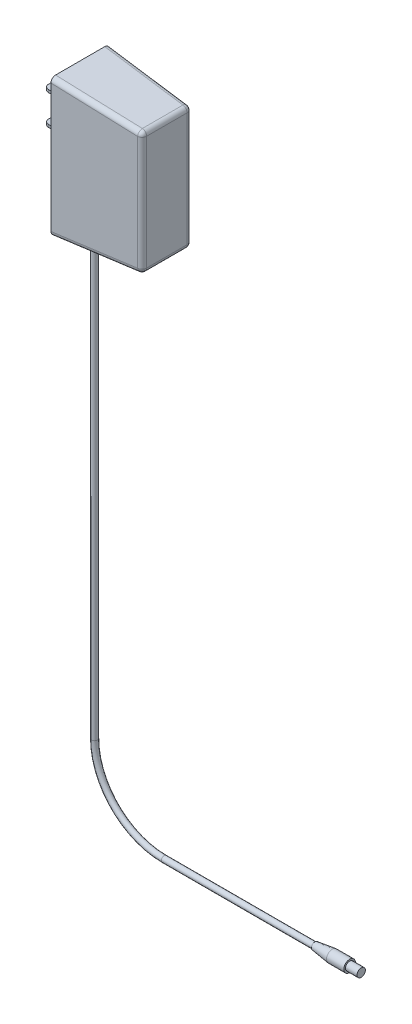
ISO-10303-21;
HEADER;
FILE_DESCRIPTION(('STEP AP214'),'2;1');
FILE_NAME('part.step','',(''),(''),'','','');
FILE_SCHEMA(('AUTOMOTIVE_DESIGN { 1 0 10303 214 1 1 1 1 }'));
ENDSEC;
DATA;
#1=APPLICATION_CONTEXT('core data for automotive mechanical design processes');
#2=APPLICATION_PROTOCOL_DEFINITION('international standard','automotive_design',2000,#1);
#3=PRODUCT_CONTEXT('',#1,'mechanical');
#4=PRODUCT('Part','Part','',(#3));
#5=PRODUCT_RELATED_PRODUCT_CATEGORY('part','',(#4));
#6=PRODUCT_DEFINITION_FORMATION('','',#4);
#7=PRODUCT_DEFINITION_CONTEXT('part definition',#1,'design');
#8=PRODUCT_DEFINITION('design','',#6,#7);
#9=PRODUCT_DEFINITION_SHAPE('','',#8);
#10=(LENGTH_UNIT() NAMED_UNIT(*) SI_UNIT(.MILLI.,.METRE.));
#11=(NAMED_UNIT(*) PLANE_ANGLE_UNIT() SI_UNIT($,.RADIAN.));
#12=(NAMED_UNIT(*) SI_UNIT($,.STERADIAN.) SOLID_ANGLE_UNIT());
#13=UNCERTAINTY_MEASURE_WITH_UNIT(LENGTH_MEASURE(1.E-05),#10,'distance_accuracy_value','');
#14=(GEOMETRIC_REPRESENTATION_CONTEXT(3) GLOBAL_UNCERTAINTY_ASSIGNED_CONTEXT((#13)) GLOBAL_UNIT_ASSIGNED_CONTEXT((#10,
#11,#12)) REPRESENTATION_CONTEXT('',''));
#15=CARTESIAN_POINT('',(0.,0.,0.));
#16=DIRECTION('',(0.,0.,1.));
#17=DIRECTION('',(1.,0.,0.));
#18=AXIS2_PLACEMENT_3D('',#15,#16,#17);
#19=CARTESIAN_POINT('',(-139.7,38.1,0.));
#20=DIRECTION('',(0.,1.,0.));
#21=DIRECTION('',(0.,0.,1.));
#22=AXIS2_PLACEMENT_3D('',#19,#20,#21);
#23=CYLINDRICAL_SURFACE('',#22,1.5875);
#24=CARTESIAN_POINT('',(-139.7,38.1,0.));
#25=DIRECTION('',(0.,-1.,0.));
#26=DIRECTION('',(0.,0.,-1.));
#27=AXIS2_PLACEMENT_3D('',#24,#25,#26);
#28=CIRCLE('',#27,1.5875);
#29=CARTESIAN_POINT('',(-141.2875,38.1,0.));
#30=VERTEX_POINT('',#29);
#31=EDGE_CURVE('E283',#30,#30,#28,.T.);
#32=ORIENTED_EDGE('',*,*,#31,.F.);
#33=EDGE_LOOP('',(#32));
#34=FACE_BOUND('',#33,.T.);
#35=CARTESIAN_POINT('',(-139.7,280.794441266737,0.));
#36=DIRECTION('',(0.0871557427476584,-0.996194698091746,0.));
#37=DIRECTION('',(0.996194698091746,0.0871557427476584,0.));
#38=AXIS2_PLACEMENT_3D('',#35,#36,#37);
#39=ELLIPSE('',#38,1.59356399210006,1.5875);
#40=CARTESIAN_POINT('',(-138.1125,280.933329520084,0.));
#41=VERTEX_POINT('',#40);
#42=EDGE_CURVE('E294',#41,#41,#39,.F.);
#43=ORIENTED_EDGE('',*,*,#42,.F.);
#44=EDGE_LOOP('',(#43));
#45=FACE_BOUND('',#44,.T.);
#46=ADVANCED_FACE('F38',(#34,#45),#23,.T.);
#47=CARTESIAN_POINT('',(0.,0.,0.));
#48=DIRECTION('',(1.,0.,0.));
#49=DIRECTION('',(0.,0.,-1.));
#50=AXIS2_PLACEMENT_3D('',#47,#48,#49);
#51=PLANE('',#50);
#52=CARTESIAN_POINT('',(0.,0.,0.));
#53=DIRECTION('',(1.,0.,0.));
#54=DIRECTION('',(0.,0.,-1.));
#55=AXIS2_PLACEMENT_3D('',#52,#53,#54);
#56=CIRCLE('',#55,3.175);
#57=CARTESIAN_POINT('',(0.,0.,-3.175));
#58=VERTEX_POINT('',#57);
#59=EDGE_CURVE('E274',#58,#58,#56,.T.);
#60=ORIENTED_EDGE('',*,*,#59,.T.);
#61=EDGE_LOOP('',(#60));
#62=FACE_BOUND('',#61,.T.);
#63=CARTESIAN_POINT('',(0.,0.,0.));
#64=DIRECTION('',(1.,0.,0.));
#65=DIRECTION('',(0.,0.,-1.));
#66=AXIS2_PLACEMENT_3D('',#63,#64,#65);
#67=CIRCLE('',#66,2.286);
#68=CARTESIAN_POINT('',(0.,0.,-2.286));
#69=VERTEX_POINT('',#68);
#70=EDGE_CURVE('E270',#69,#69,#67,.T.);
#71=ORIENTED_EDGE('',*,*,#70,.F.);
#72=EDGE_LOOP('',(#71));
#73=FACE_BOUND('',#72,.T.);
#74=ADVANCED_FACE('F498',(#62,#73),#51,.T.);
#75=CARTESIAN_POINT('',(-101.6,0.,0.));
#76=DIRECTION('',(1.,0.,0.));
#77=DIRECTION('',(0.,1.,0.));
#78=AXIS2_PLACEMENT_3D('',#75,#76,#77);
#79=CYLINDRICAL_SURFACE('',#78,1.5875);
#80=CARTESIAN_POINT('',(-101.6,0.,0.));
#81=DIRECTION('',(1.,0.,0.));
#82=DIRECTION('',(0.,0.,-1.));
#83=AXIS2_PLACEMENT_3D('',#80,#81,#82);
#84=CIRCLE('',#83,1.5875);
#85=CARTESIAN_POINT('',(-101.6,-1.58750000000001,0.));
#86=VERTEX_POINT('',#85);
#87=EDGE_CURVE('E280',#86,#86,#84,.T.);
#88=ORIENTED_EDGE('',*,*,#87,.T.);
#89=EDGE_LOOP('',(#88));
#90=FACE_BOUND('',#89,.T.);
#91=CARTESIAN_POINT('',(-19.05,0.,0.));
#92=DIRECTION('',(1.,0.,0.));
#93=DIRECTION('',(0.,0.,-1.));
#94=AXIS2_PLACEMENT_3D('',#91,#92,#93);
#95=CIRCLE('',#94,1.5875);
#96=CARTESIAN_POINT('',(-19.05,0.,-1.5875));
#97=VERTEX_POINT('',#96);
#98=EDGE_CURVE('E279',#97,#97,#95,.F.);
#99=ORIENTED_EDGE('',*,*,#98,.T.);
#100=EDGE_LOOP('',(#99));
#101=FACE_BOUND('',#100,.T.);
#102=ADVANCED_FACE('F504',(#90,#101),#79,.T.);
#103=CARTESIAN_POINT('',(-101.6,38.1,0.));
#104=DIRECTION('',(0.,0.,-1.));
#105=DIRECTION('',(-1.,0.,0.));
#106=AXIS2_PLACEMENT_3D('',#103,#104,#105);
#107=TOROIDAL_SURFACE('',#106,38.1,1.5875);
#108=CARTESIAN_POINT('',(-101.6,38.1,0.));
#109=DIRECTION('',(0.,0.,-1.));
#110=DIRECTION('',(-1.,0.,0.));
#111=AXIS2_PLACEMENT_3D('',#108,#109,#110);
#112=CIRCLE('',#111,39.6875);
#113=EDGE_CURVE('',#86,#30,#112,.T.);
#114=ORIENTED_EDGE('',*,*,#87,.F.);
#115=ORIENTED_EDGE('',*,*,#31,.T.);
#116=ORIENTED_EDGE('',*,*,#113,.T.);
#117=ORIENTED_EDGE('',*,*,#113,.F.);
#118=EDGE_LOOP('',(#114,#116,#115,#117));
#119=FACE_BOUND('',#118,.T.);
#120=ADVANCED_FACE('F511',(#119),#107,.T.);
#121=CARTESIAN_POINT('',(-19.05,0.,0.));
#122=DIRECTION('',(1.,0.,0.));
#123=DIRECTION('',(0.,0.,-1.));
#124=AXIS2_PLACEMENT_3D('',#121,#122,#123);
#125=CYLINDRICAL_SURFACE('',#124,3.175);
#126=CARTESIAN_POINT('',(-9.524999999995,0.,0.));
#127=DIRECTION('',(1.,0.,0.));
#128=DIRECTION('',(0.,0.,-1.));
#129=AXIS2_PLACEMENT_3D('',#126,#127,#128);
#130=CIRCLE('',#129,3.175);
#131=CARTESIAN_POINT('',(-9.524999999995,0.,-3.175));
#132=VERTEX_POINT('',#131);
#133=EDGE_CURVE('E286',#132,#132,#130,.T.);
#134=ORIENTED_EDGE('',*,*,#133,.T.);
#135=EDGE_LOOP('',(#134));
#136=FACE_BOUND('',#135,.T.);
#137=ORIENTED_EDGE('',*,*,#59,.F.);
#138=EDGE_LOOP('',(#137));
#139=FACE_BOUND('',#138,.T.);
#140=ADVANCED_FACE('F814',(#136,#139),#125,.T.);
#141=CARTESIAN_POINT('',(-19.05,0.,0.));
#142=DIRECTION('',(1.,0.,0.));
#143=DIRECTION('',(0.,0.,-1.));
#144=AXIS2_PLACEMENT_3D('',#141,#142,#143);
#145=PLANE('',#144);
#146=CARTESIAN_POINT('',(-19.05,0.,0.));
#147=DIRECTION('',(1.,0.,0.));
#148=DIRECTION('',(0.,0.,-1.));
#149=AXIS2_PLACEMENT_3D('',#146,#147,#148);
#150=CIRCLE('',#149,1.90499999999937);
#151=CARTESIAN_POINT('',(-19.05,0.,-1.90499999999937));
#152=VERTEX_POINT('',#151);
#153=EDGE_CURVE('E291',#152,#152,#150,.F.);
#154=ORIENTED_EDGE('',*,*,#153,.T.);
#155=EDGE_LOOP('',(#154));
#156=FACE_BOUND('',#155,.T.);
#157=ORIENTED_EDGE('',*,*,#98,.F.);
#158=EDGE_LOOP('',(#157));
#159=FACE_BOUND('',#158,.T.);
#160=ADVANCED_FACE('F808',(#156,#159),#145,.F.);
#161=CARTESIAN_POINT('',(6.35,0.,0.));
#162=DIRECTION('',(-1.,0.,0.));
#163=DIRECTION('',(0.,0.,1.));
#164=AXIS2_PLACEMENT_3D('',#161,#162,#163);
#165=CYLINDRICAL_SURFACE('',#164,2.286);
#166=CARTESIAN_POINT('',(6.35,0.,0.));
#167=DIRECTION('',(1.,0.,0.));
#168=DIRECTION('',(0.,0.,-1.));
#169=AXIS2_PLACEMENT_3D('',#166,#167,#168);
#170=CIRCLE('',#169,2.286);
#171=CARTESIAN_POINT('',(6.35,0.,-2.286));
#172=VERTEX_POINT('',#171);
#173=EDGE_CURVE('E271',#172,#172,#170,.T.);
#174=ORIENTED_EDGE('',*,*,#173,.F.);
#175=EDGE_LOOP('',(#174));
#176=FACE_BOUND('',#175,.T.);
#177=ORIENTED_EDGE('',*,*,#70,.T.);
#178=EDGE_LOOP('',(#177));
#179=FACE_BOUND('',#178,.T.);
#180=ADVANCED_FACE('F813',(#176,#179),#165,.T.);
#181=CARTESIAN_POINT('',(6.35,0.,0.));
#182=DIRECTION('',(1.,0.,0.));
#183=DIRECTION('',(0.,0.,-1.));
#184=AXIS2_PLACEMENT_3D('',#181,#182,#183);
#185=PLANE('',#184);
#186=ORIENTED_EDGE('',*,*,#173,.T.);
#187=EDGE_LOOP('',(#186));
#188=FACE_BOUND('',#187,.T.);
#189=ADVANCED_FACE('F514',(#188),#185,.T.);
#190=CARTESIAN_POINT('',(-9.524999999995,0.,0.));
#191=DIRECTION('',(1.,0.,0.));
#192=DIRECTION('',(0.,0.,-1.));
#193=AXIS2_PLACEMENT_3D('',#190,#191,#192);
#194=CONICAL_SURFACE('',#193,3.175,0.13255153229667);
#195=ORIENTED_EDGE('',*,*,#153,.F.);
#196=EDGE_LOOP('',(#195));
#197=FACE_BOUND('',#196,.T.);
#198=ORIENTED_EDGE('',*,*,#133,.F.);
#199=EDGE_LOOP('',(#198));
#200=FACE_BOUND('',#199,.T.);
#201=ADVANCED_FACE('F494',(#197,#200),#194,.T.);
#202=CARTESIAN_POINT('',(-147.6375,280.1,16.));
#203=DIRECTION('',(0.0871557427476584,-0.996194698091746,0.));
#204=DIRECTION('',(0.996194698091746,0.0871557427476584,0.));
#205=AXIS2_PLACEMENT_3D('',#202,#203,#204);
#206=PLANE('',#205);
#207=DIRECTION('',(0.,0.,-1.));
#208=VECTOR('',#207,1.);
#209=CARTESIAN_POINT('',(-102.456124413421,284.052858166333,16.));
#210=LINE('',#209,#208);
#211=CARTESIAN_POINT('',(-102.456124413421,284.052858166333,-11.1002604845997));
#212=VERTEX_POINT('',#211);
#213=CARTESIAN_POINT('',(-102.456124413421,284.052858166333,11.1002604845997));
#214=VERTEX_POINT('',#213);
#215=EDGE_CURVE('E308',#212,#214,#210,.F.);
#216=ORIENTED_EDGE('',*,*,#215,.T.);
#217=DIRECTION('',(0.994839797341939,0.0870372042918475,-0.0521373445210819));
#218=VECTOR('',#217,1.);
#219=CARTESIAN_POINT('',(-147.768824529903,280.088510592391,13.474998471023));
#220=LINE('',#219,#218);
#221=CARTESIAN_POINT('',(-147.6375,280.1,13.4681160440454));
#222=VERTEX_POINT('',#221);
#223=EDGE_CURVE('E311',#214,#222,#220,.F.);
#224=ORIENTED_EDGE('',*,*,#223,.T.);
#225=DIRECTION('',(0.,0.,-1.));
#226=VECTOR('',#225,1.);
#227=CARTESIAN_POINT('',(-147.6375,280.1,16.));
#228=LINE('',#227,#226);
#229=CARTESIAN_POINT('',(-147.6375,280.1,-13.4681160440454));
#230=VERTEX_POINT('',#229);
#231=EDGE_CURVE('E262',#222,#230,#228,.T.);
#232=ORIENTED_EDGE('',*,*,#231,.T.);
#233=DIRECTION('',(-0.994839797341939,-0.0870372042918475,-0.0521373445210819));
#234=VECTOR('',#233,1.);
#235=CARTESIAN_POINT('',(-146.10903876167,280.233723030993,-13.3880127848243));
#236=LINE('',#235,#234);
#237=EDGE_CURVE('E306',#230,#212,#236,.F.);
#238=ORIENTED_EDGE('',*,*,#237,.T.);
#239=EDGE_LOOP('',(#216,#224,#232,#238));
#240=FACE_BOUND('',#239,.T.);
#241=ORIENTED_EDGE('',*,*,#42,.T.);
#242=EDGE_LOOP('',(#241));
#243=FACE_BOUND('',#242,.T.);
#244=ADVANCED_FACE('F480',(#240,#243),#206,.T.);
#245=CARTESIAN_POINT('',(-100.1375,280.1,16.));
#246=DIRECTION('',(-1.,0.,0.));
#247=DIRECTION('',(0.,-1.,0.));
#248=AXIS2_PLACEMENT_3D('',#245,#246,#247);
#249=PLANE('',#248);
#250=DIRECTION('',(0.,1.,0.));
#251=VECTOR('',#250,1.);
#252=CARTESIAN_POINT('',(-100.1375,284.255711517481,11.1002604845997));
#253=LINE('',#252,#251);
#254=CARTESIAN_POINT('',(-100.1375,349.116807300514,11.1002604845997));
#255=VERTEX_POINT('',#254);
#256=CARTESIAN_POINT('',(-100.1375,286.583192699486,11.1002604845997));
#257=VERTEX_POINT('',#256);
#258=EDGE_CURVE('E301',#255,#257,#253,.F.);
#259=ORIENTED_EDGE('',*,*,#258,.T.);
#260=DIRECTION('',(0.,0.,1.));
#261=VECTOR('',#260,1.);
#262=CARTESIAN_POINT('',(-100.1375,286.583192699486,16.));
#263=LINE('',#262,#261);
#264=CARTESIAN_POINT('',(-100.1375,286.583192699486,-11.1002604845997));
#265=VERTEX_POINT('',#264);
#266=EDGE_CURVE('E303',#257,#265,#263,.F.);
#267=ORIENTED_EDGE('',*,*,#266,.T.);
#268=DIRECTION('',(0.,-1.,0.));
#269=VECTOR('',#268,1.);
#270=CARTESIAN_POINT('',(-100.1375,280.1,-11.1002604845997));
#271=LINE('',#270,#269);
#272=CARTESIAN_POINT('',(-100.1375,349.116807300514,-11.1002604845997));
#273=VERTEX_POINT('',#272);
#274=EDGE_CURVE('E297',#265,#273,#271,.F.);
#275=ORIENTED_EDGE('',*,*,#274,.T.);
#276=DIRECTION('',(0.,0.,1.));
#277=VECTOR('',#276,1.);
#278=CARTESIAN_POINT('',(-100.1375,349.116807300514,16.));
#279=LINE('',#278,#277);
#280=EDGE_CURVE('E299',#273,#255,#279,.T.);
#281=ORIENTED_EDGE('',*,*,#280,.T.);
#282=EDGE_LOOP('',(#259,#267,#275,#281));
#283=FACE_BOUND('',#282,.T.);
#284=ADVANCED_FACE('F420',(#283),#249,.F.);
#285=CARTESIAN_POINT('',(-147.6375,355.6,16.));
#286=DIRECTION('',(1.,0.,0.));
#287=DIRECTION('',(0.,0.,-1.));
#288=AXIS2_PLACEMENT_3D('',#285,#286,#287);
#289=PLANE('',#288);
#290=DIRECTION('',(0.,0.,-1.));
#291=VECTOR('',#290,1.);
#292=CARTESIAN_POINT('',(-147.6375,319.29,4.));
#293=LINE('',#292,#291);
#294=CARTESIAN_POINT('',(-147.6375,319.29,4.));
#295=VERTEX_POINT('',#294);
#296=CARTESIAN_POINT('',(-147.6375,319.29,-4.));
#297=VERTEX_POINT('',#296);
#298=EDGE_CURVE('E216',#295,#297,#293,.T.);
#299=ORIENTED_EDGE('',*,*,#298,.T.);
#300=DIRECTION('',(0.,1.,0.));
#301=VECTOR('',#300,1.);
#302=CARTESIAN_POINT('',(-147.6375,319.29,-4.));
#303=LINE('',#302,#301);
#304=CARTESIAN_POINT('',(-147.6375,320.79,-4.));
#305=VERTEX_POINT('',#304);
#306=EDGE_CURVE('E195',#297,#305,#303,.T.);
#307=ORIENTED_EDGE('',*,*,#306,.T.);
#308=DIRECTION('',(0.,0.,1.));
#309=VECTOR('',#308,1.);
#310=CARTESIAN_POINT('',(-147.6375,320.79,4.));
#311=LINE('',#310,#309);
#312=CARTESIAN_POINT('',(-147.6375,320.79,4.));
#313=VERTEX_POINT('',#312);
#314=EDGE_CURVE('E204',#305,#313,#311,.T.);
#315=ORIENTED_EDGE('',*,*,#314,.T.);
#316=DIRECTION('',(0.,-1.,0.));
#317=VECTOR('',#316,1.);
#318=CARTESIAN_POINT('',(-147.6375,319.29,4.));
#319=LINE('',#318,#317);
#320=EDGE_CURVE('E211',#313,#295,#319,.T.);
#321=ORIENTED_EDGE('',*,*,#320,.T.);
#322=EDGE_LOOP('',(#299,#307,#315,#321));
#323=FACE_BOUND('',#322,.T.);
#324=DIRECTION('',(0.,0.,-1.));
#325=VECTOR('',#324,1.);
#326=CARTESIAN_POINT('',(-147.6375,335.8,4.));
#327=LINE('',#326,#325);
#328=CARTESIAN_POINT('',(-147.6375,335.8,4.));
#329=VERTEX_POINT('',#328);
#330=CARTESIAN_POINT('',(-147.6375,335.8,-4.));
#331=VERTEX_POINT('',#330);
#332=EDGE_CURVE('E238',#329,#331,#327,.T.);
#333=ORIENTED_EDGE('',*,*,#332,.T.);
#334=DIRECTION('',(0.,1.,0.));
#335=VECTOR('',#334,1.);
#336=CARTESIAN_POINT('',(-147.6375,335.8,-4.));
#337=LINE('',#336,#335);
#338=CARTESIAN_POINT('',(-147.6375,337.3,-4.));
#339=VERTEX_POINT('',#338);
#340=EDGE_CURVE('E230',#331,#339,#337,.T.);
#341=ORIENTED_EDGE('',*,*,#340,.T.);
#342=DIRECTION('',(0.,0.,1.));
#343=VECTOR('',#342,1.);
#344=CARTESIAN_POINT('',(-147.6375,337.3,4.));
#345=LINE('',#344,#343);
#346=CARTESIAN_POINT('',(-147.6375,337.3,4.));
#347=VERTEX_POINT('',#346);
#348=EDGE_CURVE('E243',#339,#347,#345,.T.);
#349=ORIENTED_EDGE('',*,*,#348,.T.);
#350=DIRECTION('',(0.,-1.,0.));
#351=VECTOR('',#350,1.);
#352=CARTESIAN_POINT('',(-147.6375,335.8,4.));
#353=LINE('',#352,#351);
#354=EDGE_CURVE('E246',#347,#329,#353,.T.);
#355=ORIENTED_EDGE('',*,*,#354,.T.);
#356=EDGE_LOOP('',(#333,#341,#349,#355));
#357=FACE_BOUND('',#356,.T.);
#358=ORIENTED_EDGE('',*,*,#231,.F.);
#359=CARTESIAN_POINT('',(-147.6375,282.64970238736,13.4565142411653));
#360=DIRECTION('',(1.,0.,0.));
#361=DIRECTION('',(0.,0.857862219266306,-0.5138797648823));
#362=AXIS2_PLACEMENT_3D('',#359,#360,#361);
#363=ELLIPSE('',#362,2.55317489990499,2.54);
#364=CARTESIAN_POINT('',(-147.6375,282.63807222808,16.));
#365=VERTEX_POINT('',#364);
#366=EDGE_CURVE('E337',#222,#365,#363,.F.);
#367=ORIENTED_EDGE('',*,*,#366,.T.);
#368=DIRECTION('',(0.,-1.,0.));
#369=VECTOR('',#368,1.);
#370=CARTESIAN_POINT('',(-147.6375,355.6,16.));
#371=LINE('',#370,#369);
#372=CARTESIAN_POINT('',(-147.6375,353.06192777192,16.));
#373=VERTEX_POINT('',#372);
#374=EDGE_CURVE('E259',#373,#365,#371,.T.);
#375=ORIENTED_EDGE('',*,*,#374,.F.);
#376=CARTESIAN_POINT('',(-147.6375,353.05029761264,13.4565142411653));
#377=DIRECTION('',(1.,0.,0.));
#378=DIRECTION('',(0.,0.857862219266306,0.5138797648823));
#379=AXIS2_PLACEMENT_3D('',#376,#377,#378);
#380=ELLIPSE('',#379,2.55317489990499,2.54);
#381=CARTESIAN_POINT('',(-147.6375,355.6,13.4681160440454));
#382=VERTEX_POINT('',#381);
#383=EDGE_CURVE('E331',#373,#382,#380,.F.);
#384=ORIENTED_EDGE('',*,*,#383,.T.);
#385=DIRECTION('',(0.,0.,-1.));
#386=VECTOR('',#385,1.);
#387=CARTESIAN_POINT('',(-147.6375,355.6,16.));
#388=LINE('',#387,#386);
#389=CARTESIAN_POINT('',(-147.6375,355.6,-13.4681160440454));
#390=VERTEX_POINT('',#389);
#391=EDGE_CURVE('E267',#382,#390,#388,.T.);
#392=ORIENTED_EDGE('',*,*,#391,.T.);
#393=CARTESIAN_POINT('',(-147.6375,353.05029761264,-13.4565142411653));
#394=DIRECTION('',(1.,0.,0.));
#395=DIRECTION('',(0.,0.857862219266306,-0.5138797648823));
#396=AXIS2_PLACEMENT_3D('',#393,#394,#395);
#397=ELLIPSE('',#396,2.55317489990499,2.54);
#398=CARTESIAN_POINT('',(-147.6375,353.06192777192,-16.));
#399=VERTEX_POINT('',#398);
#400=EDGE_CURVE('E333',#390,#399,#397,.F.);
#401=ORIENTED_EDGE('',*,*,#400,.T.);
#402=DIRECTION('',(0.,-1.,0.));
#403=VECTOR('',#402,1.);
#404=CARTESIAN_POINT('',(-147.6375,355.6,-16.));
#405=LINE('',#404,#403);
#406=CARTESIAN_POINT('',(-147.6375,282.63807222808,-16.));
#407=VERTEX_POINT('',#406);
#408=EDGE_CURVE('E253',#399,#407,#405,.T.);
#409=ORIENTED_EDGE('',*,*,#408,.T.);
#410=CARTESIAN_POINT('',(-147.6375,282.64970238736,-13.4565142411653));
#411=DIRECTION('',(1.,0.,0.));
#412=DIRECTION('',(0.,0.857862219266306,0.5138797648823));
#413=AXIS2_PLACEMENT_3D('',#410,#411,#412);
#414=ELLIPSE('',#413,2.55317489990499,2.54);
#415=EDGE_CURVE('E335',#407,#230,#414,.F.);
#416=ORIENTED_EDGE('',*,*,#415,.T.);
#417=EDGE_LOOP('',(#358,#367,#375,#384,#392,#401,#409,#416));
#418=FACE_BOUND('',#417,.T.);
#419=ADVANCED_FACE('F213',(#323,#357,#418),#289,.F.);
#420=CARTESIAN_POINT('',(-147.6375,355.6,16.));
#421=DIRECTION('',(0.0523359562429439,0.,0.998629534754574));
#422=DIRECTION('',(0.998629534754574,0.,-0.052335956242944));
#423=AXIS2_PLACEMENT_3D('',#420,#421,#422);
#424=PLANE('',#423);
#425=ORIENTED_EDGE('',*,*,#374,.T.);
#426=DIRECTION('',(-0.994839797341939,-0.0870372042918475,0.0521373445210819));
#427=VECTOR('',#426,1.);
#428=CARTESIAN_POINT('',(-100.357266787625,286.774556643025,13.5221479733552));
#429=LINE('',#428,#427);
#430=CARTESIAN_POINT('',(-102.544566671143,286.583192699486,13.6367795028764));
#431=VERTEX_POINT('',#430);
#432=EDGE_CURVE('E317',#365,#431,#429,.F.);
#433=ORIENTED_EDGE('',*,*,#432,.T.);
#434=DIRECTION('',(0.,1.,0.));
#435=VECTOR('',#434,1.);
#436=CARTESIAN_POINT('',(-102.544566671143,351.444288482519,13.6367795028764));
#437=LINE('',#436,#435);
#438=CARTESIAN_POINT('',(-102.544566671143,349.116807300514,13.6367795028764));
#439=VERTEX_POINT('',#438);
#440=EDGE_CURVE('E315',#431,#439,#437,.T.);
#441=ORIENTED_EDGE('',*,*,#440,.T.);
#442=DIRECTION('',(0.994839797341939,-0.0870372042918475,-0.0521373445210819));
#443=VECTOR('',#442,1.);
#444=CARTESIAN_POINT('',(-147.857266787625,353.081154874456,16.0115174892996));
#445=LINE('',#444,#443);
#446=EDGE_CURVE('E313',#439,#373,#445,.F.);
#447=ORIENTED_EDGE('',*,*,#446,.T.);
#448=EDGE_LOOP('',(#425,#433,#441,#447));
#449=FACE_BOUND('',#448,.T.);
#450=ADVANCED_FACE('F419',(#449),#424,.T.);
#451=CARTESIAN_POINT('',(-147.6375,355.6,-16.));
#452=DIRECTION('',(0.0523359562429439,0.,-0.998629534754574));
#453=DIRECTION('',(-0.998629534754574,0.,-0.052335956242944));
#454=AXIS2_PLACEMENT_3D('',#451,#452,#453);
#455=PLANE('',#454);
#456=DIRECTION('',(0.,1.,0.));
#457=VECTOR('',#456,1.);
#458=CARTESIAN_POINT('',(-102.544566671143,355.6,-13.6367795028764));
#459=LINE('',#458,#457);
#460=CARTESIAN_POINT('',(-102.544566671143,349.116807300514,-13.6367795028764));
#461=VERTEX_POINT('',#460);
#462=CARTESIAN_POINT('',(-102.544566671143,286.583192699486,-13.6367795028764));
#463=VERTEX_POINT('',#462);
#464=EDGE_CURVE('E327',#461,#463,#459,.F.);
#465=ORIENTED_EDGE('',*,*,#464,.T.);
#466=DIRECTION('',(-0.994839797341939,-0.0870372042918475,-0.0521373445210819));
#467=VECTOR('',#466,1.);
#468=CARTESIAN_POINT('',(-141.319867149368,283.19079348283,-15.6689068919728));
#469=LINE('',#468,#467);
#470=EDGE_CURVE('E329',#463,#407,#469,.T.);
#471=ORIENTED_EDGE('',*,*,#470,.T.);
#472=ORIENTED_EDGE('',*,*,#408,.F.);
#473=DIRECTION('',(0.994839797341939,-0.0870372042918475,0.0521373445210819));
#474=VECTOR('',#473,1.);
#475=CARTESIAN_POINT('',(-147.857266787625,353.081154874456,-16.0115174892996));
#476=LINE('',#475,#474);
#477=EDGE_CURVE('E325',#399,#461,#476,.T.);
#478=ORIENTED_EDGE('',*,*,#477,.T.);
#479=EDGE_LOOP('',(#465,#471,#472,#478));
#480=FACE_BOUND('',#479,.T.);
#481=ADVANCED_FACE('F474',(#480),#455,.T.);
#482=CARTESIAN_POINT('',(-147.6375,355.6,16.));
#483=DIRECTION('',(0.0871557427476584,0.996194698091746,0.));
#484=DIRECTION('',(-0.996194698091746,0.0871557427476584,0.));
#485=AXIS2_PLACEMENT_3D('',#482,#483,#484);
#486=PLANE('',#485);
#487=DIRECTION('',(0.,0.,-1.));
#488=VECTOR('',#487,1.);
#489=CARTESIAN_POINT('',(-102.456124413421,351.647141833667,16.));
#490=LINE('',#489,#488);
#491=CARTESIAN_POINT('',(-102.456124413421,351.647141833667,11.1002604845997));
#492=VERTEX_POINT('',#491);
#493=CARTESIAN_POINT('',(-102.456124413421,351.647141833667,-11.1002604845997));
#494=VERTEX_POINT('',#493);
#495=EDGE_CURVE('E321',#492,#494,#490,.T.);
#496=ORIENTED_EDGE('',*,*,#495,.T.);
#497=DIRECTION('',(0.994839797341939,-0.0870372042918475,0.0521373445210819));
#498=VECTOR('',#497,1.);
#499=CARTESIAN_POINT('',(-146.10903876167,355.466276969007,-13.3880127848243));
#500=LINE('',#499,#498);
#501=EDGE_CURVE('E323',#494,#390,#500,.F.);
#502=ORIENTED_EDGE('',*,*,#501,.T.);
#503=ORIENTED_EDGE('',*,*,#391,.F.);
#504=DIRECTION('',(-0.994839797341939,0.0870372042918475,0.0521373445210819));
#505=VECTOR('',#504,1.);
#506=CARTESIAN_POINT('',(-100.268824529903,351.455777890128,10.9856289550785));
#507=LINE('',#506,#505);
#508=EDGE_CURVE('E319',#382,#492,#507,.F.);
#509=ORIENTED_EDGE('',*,*,#508,.T.);
#510=EDGE_LOOP('',(#496,#502,#503,#509));
#511=FACE_BOUND('',#510,.T.);
#512=ADVANCED_FACE('F453',(#511),#486,.T.);
#513=CARTESIAN_POINT('',(-163.5175,335.8,-4.));
#514=DIRECTION('',(0.,0.,-1.));
#515=DIRECTION('',(0.,1.,0.));
#516=AXIS2_PLACEMENT_3D('',#513,#514,#515);
#517=PLANE('',#516);
#518=DIRECTION('',(1.,0.,0.));
#519=VECTOR('',#518,1.);
#520=CARTESIAN_POINT('',(-163.5175,335.8,-4.));
#521=LINE('',#520,#519);
#522=CARTESIAN_POINT('',(-160.9775,335.8,-4.));
#523=VERTEX_POINT('',#522);
#524=EDGE_CURVE('E251',#523,#331,#521,.T.);
#525=ORIENTED_EDGE('',*,*,#524,.F.);
#526=DIRECTION('',(0.,1.,0.));
#527=VECTOR('',#526,1.);
#528=CARTESIAN_POINT('',(-160.9775,335.8,-4.));
#529=LINE('',#528,#527);
#530=CARTESIAN_POINT('',(-160.9775,337.3,-4.));
#531=VERTEX_POINT('',#530);
#532=EDGE_CURVE('E385',#523,#531,#529,.T.);
#533=ORIENTED_EDGE('',*,*,#532,.T.);
#534=DIRECTION('',(1.,0.,0.));
#535=VECTOR('',#534,1.);
#536=CARTESIAN_POINT('',(-163.5175,337.3,-4.));
#537=LINE('',#536,#535);
#538=EDGE_CURVE('E240',#531,#339,#537,.T.);
#539=ORIENTED_EDGE('',*,*,#538,.T.);
#540=ORIENTED_EDGE('',*,*,#340,.F.);
#541=EDGE_LOOP('',(#525,#533,#539,#540));
#542=FACE_BOUND('',#541,.T.);
#543=ADVANCED_FACE('F404',(#542),#517,.T.);
#544=CARTESIAN_POINT('',(-163.5175,335.8,4.));
#545=DIRECTION('',(0.,-1.,0.));
#546=DIRECTION('',(1.,0.,0.));
#547=AXIS2_PLACEMENT_3D('',#544,#545,#546);
#548=PLANE('',#547);
#549=DIRECTION('',(0.,0.,-1.));
#550=VECTOR('',#549,1.);
#551=CARTESIAN_POINT('',(-163.5175,335.8,4.));
#552=LINE('',#551,#550);
#553=CARTESIAN_POINT('',(-163.5175,335.8,1.46));
#554=VERTEX_POINT('',#553);
#555=CARTESIAN_POINT('',(-163.5175,335.8,-1.46));
#556=VERTEX_POINT('',#555);
#557=EDGE_CURVE('E237',#554,#556,#552,.T.);
#558=ORIENTED_EDGE('',*,*,#557,.T.);
#559=CARTESIAN_POINT('',(-160.9775,335.8,-1.46));
#560=DIRECTION('',(0.,-1.,0.));
#561=DIRECTION('',(1.,0.,0.));
#562=AXIS2_PLACEMENT_3D('',#559,#560,#561);
#563=CIRCLE('',#562,2.54);
#564=EDGE_CURVE('E46',#556,#523,#563,.T.);
#565=ORIENTED_EDGE('',*,*,#564,.T.);
#566=ORIENTED_EDGE('',*,*,#524,.T.);
#567=ORIENTED_EDGE('',*,*,#332,.F.);
#568=DIRECTION('',(1.,0.,0.));
#569=VECTOR('',#568,1.);
#570=CARTESIAN_POINT('',(-163.5175,335.8,4.));
#571=LINE('',#570,#569);
#572=CARTESIAN_POINT('',(-160.9775,335.8,4.));
#573=VERTEX_POINT('',#572);
#574=EDGE_CURVE('E254',#573,#329,#571,.T.);
#575=ORIENTED_EDGE('',*,*,#574,.F.);
#576=CARTESIAN_POINT('',(-160.9775,335.8,1.46));
#577=DIRECTION('',(0.,-1.,0.));
#578=DIRECTION('',(1.,0.,0.));
#579=AXIS2_PLACEMENT_3D('',#576,#577,#578);
#580=CIRCLE('',#579,2.54);
#581=EDGE_CURVE('E53',#573,#554,#580,.T.);
#582=ORIENTED_EDGE('',*,*,#581,.T.);
#583=EDGE_LOOP('',(#558,#565,#566,#567,#575,#582));
#584=FACE_BOUND('',#583,.T.);
#585=ADVANCED_FACE('F398',(#584),#548,.T.);
#586=CARTESIAN_POINT('',(-163.5175,335.8,4.));
#587=DIRECTION('',(0.,0.,1.));
#588=DIRECTION('',(1.,0.,0.));
#589=AXIS2_PLACEMENT_3D('',#586,#587,#588);
#590=PLANE('',#589);
#591=DIRECTION('',(1.,0.,0.));
#592=VECTOR('',#591,1.);
#593=CARTESIAN_POINT('',(-163.5175,337.3,4.));
#594=LINE('',#593,#592);
#595=CARTESIAN_POINT('',(-160.9775,337.3,4.));
#596=VERTEX_POINT('',#595);
#597=EDGE_CURVE('E256',#596,#347,#594,.T.);
#598=ORIENTED_EDGE('',*,*,#597,.F.);
#599=DIRECTION('',(0.,-1.,0.));
#600=VECTOR('',#599,1.);
#601=CARTESIAN_POINT('',(-160.9775,335.8,4.));
#602=LINE('',#601,#600);
#603=EDGE_CURVE('E11',#596,#573,#602,.T.);
#604=ORIENTED_EDGE('',*,*,#603,.T.);
#605=ORIENTED_EDGE('',*,*,#574,.T.);
#606=ORIENTED_EDGE('',*,*,#354,.F.);
#607=EDGE_LOOP('',(#598,#604,#605,#606));
#608=FACE_BOUND('',#607,.T.);
#609=ADVANCED_FACE('F415',(#608),#590,.T.);
#610=CARTESIAN_POINT('',(-163.5175,337.3,4.));
#611=DIRECTION('',(0.,1.,0.));
#612=DIRECTION('',(-1.,0.,0.));
#613=AXIS2_PLACEMENT_3D('',#610,#611,#612);
#614=PLANE('',#613);
#615=ORIENTED_EDGE('',*,*,#538,.F.);
#616=CARTESIAN_POINT('',(-160.9775,337.3,-1.46));
#617=DIRECTION('',(0.,1.,0.));
#618=DIRECTION('',(-1.,0.,0.));
#619=AXIS2_PLACEMENT_3D('',#616,#617,#618);
#620=CIRCLE('',#619,2.54);
#621=CARTESIAN_POINT('',(-163.5175,337.3,-1.46));
#622=VERTEX_POINT('',#621);
#623=EDGE_CURVE('E390',#531,#622,#620,.T.);
#624=ORIENTED_EDGE('',*,*,#623,.T.);
#625=DIRECTION('',(0.,0.,1.));
#626=VECTOR('',#625,1.);
#627=CARTESIAN_POINT('',(-163.5175,337.3,4.));
#628=LINE('',#627,#626);
#629=CARTESIAN_POINT('',(-163.5175,337.3,1.46));
#630=VERTEX_POINT('',#629);
#631=EDGE_CURVE('E234',#622,#630,#628,.T.);
#632=ORIENTED_EDGE('',*,*,#631,.T.);
#633=CARTESIAN_POINT('',(-160.9775,337.3,1.46));
#634=DIRECTION('',(0.,1.,0.));
#635=DIRECTION('',(-1.,0.,0.));
#636=AXIS2_PLACEMENT_3D('',#633,#634,#635);
#637=CIRCLE('',#636,2.54);
#638=EDGE_CURVE('E388',#630,#596,#637,.T.);
#639=ORIENTED_EDGE('',*,*,#638,.T.);
#640=ORIENTED_EDGE('',*,*,#597,.T.);
#641=ORIENTED_EDGE('',*,*,#348,.F.);
#642=EDGE_LOOP('',(#615,#624,#632,#639,#640,#641));
#643=FACE_BOUND('',#642,.T.);
#644=ADVANCED_FACE('F408',(#643),#614,.T.);
#645=CARTESIAN_POINT('',(-163.5175,0.,0.));
#646=DIRECTION('',(-1.,0.,0.));
#647=DIRECTION('',(0.,0.,1.));
#648=AXIS2_PLACEMENT_3D('',#645,#646,#647);
#649=PLANE('',#648);
#650=ORIENTED_EDGE('',*,*,#631,.F.);
#651=DIRECTION('',(0.,1.,0.));
#652=VECTOR('',#651,1.);
#653=CARTESIAN_POINT('',(-163.5175,0.,-1.45999999999981));
#654=LINE('',#653,#652);
#655=EDGE_CURVE('E60',#622,#556,#654,.F.);
#656=ORIENTED_EDGE('',*,*,#655,.T.);
#657=ORIENTED_EDGE('',*,*,#557,.F.);
#658=DIRECTION('',(0.,-1.,0.));
#659=VECTOR('',#658,1.);
#660=CARTESIAN_POINT('',(-163.5175,0.,1.46));
#661=LINE('',#660,#659);
#662=EDGE_CURVE('E392',#554,#630,#661,.F.);
#663=ORIENTED_EDGE('',*,*,#662,.T.);
#664=EDGE_LOOP('',(#650,#656,#657,#663));
#665=FACE_BOUND('',#664,.T.);
#666=ADVANCED_FACE('F411',(#665),#649,.T.);
#667=CARTESIAN_POINT('',(-163.5175,319.29,-4.));
#668=DIRECTION('',(0.,0.,-1.));
#669=DIRECTION('',(0.,1.,0.));
#670=AXIS2_PLACEMENT_3D('',#667,#668,#669);
#671=PLANE('',#670);
#672=DIRECTION('',(1.,0.,0.));
#673=VECTOR('',#672,1.);
#674=CARTESIAN_POINT('',(-163.5175,319.29,-4.));
#675=LINE('',#674,#673);
#676=CARTESIAN_POINT('',(-160.9775,319.29,-4.));
#677=VERTEX_POINT('',#676);
#678=EDGE_CURVE('E228',#677,#297,#675,.T.);
#679=ORIENTED_EDGE('',*,*,#678,.F.);
#680=DIRECTION('',(0.,1.,0.));
#681=VECTOR('',#680,1.);
#682=CARTESIAN_POINT('',(-160.9775,319.29,-4.));
#683=LINE('',#682,#681);
#684=CARTESIAN_POINT('',(-160.9775,320.79,-4.));
#685=VERTEX_POINT('',#684);
#686=EDGE_CURVE('E198',#677,#685,#683,.T.);
#687=ORIENTED_EDGE('',*,*,#686,.T.);
#688=DIRECTION('',(1.,0.,0.));
#689=VECTOR('',#688,1.);
#690=CARTESIAN_POINT('',(-163.5175,320.79,-4.));
#691=LINE('',#690,#689);
#692=EDGE_CURVE('E190',#685,#305,#691,.T.);
#693=ORIENTED_EDGE('',*,*,#692,.T.);
#694=ORIENTED_EDGE('',*,*,#306,.F.);
#695=EDGE_LOOP('',(#679,#687,#693,#694));
#696=FACE_BOUND('',#695,.T.);
#697=ADVANCED_FACE('F193',(#696),#671,.T.);
#698=CARTESIAN_POINT('',(-163.5175,319.29,4.));
#699=DIRECTION('',(0.,-1.,0.));
#700=DIRECTION('',(1.,0.,0.));
#701=AXIS2_PLACEMENT_3D('',#698,#699,#700);
#702=PLANE('',#701);
#703=DIRECTION('',(1.,0.,0.));
#704=VECTOR('',#703,1.);
#705=CARTESIAN_POINT('',(-163.5175,319.29,4.));
#706=LINE('',#705,#704);
#707=CARTESIAN_POINT('',(-160.9775,319.29,4.));
#708=VERTEX_POINT('',#707);
#709=EDGE_CURVE('E231',#708,#295,#706,.T.);
#710=ORIENTED_EDGE('',*,*,#709,.F.);
#711=CARTESIAN_POINT('',(-160.9775,319.29,1.46));
#712=DIRECTION('',(0.,-1.,0.));
#713=DIRECTION('',(1.,0.,0.));
#714=AXIS2_PLACEMENT_3D('',#711,#712,#713);
#715=CIRCLE('',#714,2.54);
#716=CARTESIAN_POINT('',(-163.5175,319.29,1.46));
#717=VERTEX_POINT('',#716);
#718=EDGE_CURVE('E374',#708,#717,#715,.T.);
#719=ORIENTED_EDGE('',*,*,#718,.T.);
#720=DIRECTION('',(0.,0.,-1.));
#721=VECTOR('',#720,1.);
#722=CARTESIAN_POINT('',(-163.5175,319.29,4.));
#723=LINE('',#722,#721);
#724=CARTESIAN_POINT('',(-163.5175,319.29,-1.46));
#725=VERTEX_POINT('',#724);
#726=EDGE_CURVE('E201',#717,#725,#723,.T.);
#727=ORIENTED_EDGE('',*,*,#726,.T.);
#728=CARTESIAN_POINT('',(-160.9775,319.29,-1.46));
#729=DIRECTION('',(0.,-1.,0.));
#730=DIRECTION('',(1.,0.,0.));
#731=AXIS2_PLACEMENT_3D('',#728,#729,#730);
#732=CIRCLE('',#731,2.54);
#733=EDGE_CURVE('E372',#725,#677,#732,.T.);
#734=ORIENTED_EDGE('',*,*,#733,.T.);
#735=ORIENTED_EDGE('',*,*,#678,.T.);
#736=ORIENTED_EDGE('',*,*,#298,.F.);
#737=EDGE_LOOP('',(#710,#719,#727,#734,#735,#736));
#738=FACE_BOUND('',#737,.T.);
#739=ADVANCED_FACE('F626',(#738),#702,.T.);
#740=CARTESIAN_POINT('',(-163.5175,319.29,4.));
#741=DIRECTION('',(0.,0.,1.));
#742=DIRECTION('',(1.,0.,0.));
#743=AXIS2_PLACEMENT_3D('',#740,#741,#742);
#744=PLANE('',#743);
#745=DIRECTION('',(1.,0.,0.));
#746=VECTOR('',#745,1.);
#747=CARTESIAN_POINT('',(-163.5175,320.79,4.));
#748=LINE('',#747,#746);
#749=CARTESIAN_POINT('',(-160.9775,320.79,4.));
#750=VERTEX_POINT('',#749);
#751=EDGE_CURVE('E200',#750,#313,#748,.T.);
#752=ORIENTED_EDGE('',*,*,#751,.F.);
#753=DIRECTION('',(0.,-1.,0.));
#754=VECTOR('',#753,1.);
#755=CARTESIAN_POINT('',(-160.9775,319.29,4.));
#756=LINE('',#755,#754);
#757=EDGE_CURVE('E339',#750,#708,#756,.T.);
#758=ORIENTED_EDGE('',*,*,#757,.T.);
#759=ORIENTED_EDGE('',*,*,#709,.T.);
#760=ORIENTED_EDGE('',*,*,#320,.F.);
#761=EDGE_LOOP('',(#752,#758,#759,#760));
#762=FACE_BOUND('',#761,.T.);
#763=ADVANCED_FACE('F631',(#762),#744,.T.);
#764=CARTESIAN_POINT('',(-163.5175,320.79,4.));
#765=DIRECTION('',(0.,1.,0.));
#766=DIRECTION('',(-1.,0.,0.));
#767=AXIS2_PLACEMENT_3D('',#764,#765,#766);
#768=PLANE('',#767);
#769=DIRECTION('',(0.,0.,1.));
#770=VECTOR('',#769,1.);
#771=CARTESIAN_POINT('',(-163.5175,320.79,4.));
#772=LINE('',#771,#770);
#773=CARTESIAN_POINT('',(-163.5175,320.79,-1.46));
#774=VERTEX_POINT('',#773);
#775=CARTESIAN_POINT('',(-163.5175,320.79,1.46));
#776=VERTEX_POINT('',#775);
#777=EDGE_CURVE('E227',#774,#776,#772,.T.);
#778=ORIENTED_EDGE('',*,*,#777,.T.);
#779=CARTESIAN_POINT('',(-160.9775,320.79,1.46));
#780=DIRECTION('',(0.,1.,0.));
#781=DIRECTION('',(-1.,0.,0.));
#782=AXIS2_PLACEMENT_3D('',#779,#780,#781);
#783=CIRCLE('',#782,2.54);
#784=EDGE_CURVE('E382',#776,#750,#783,.T.);
#785=ORIENTED_EDGE('',*,*,#784,.T.);
#786=ORIENTED_EDGE('',*,*,#751,.T.);
#787=ORIENTED_EDGE('',*,*,#314,.F.);
#788=ORIENTED_EDGE('',*,*,#692,.F.);
#789=CARTESIAN_POINT('',(-160.9775,320.79,-1.46));
#790=DIRECTION('',(0.,1.,0.));
#791=DIRECTION('',(-1.,0.,0.));
#792=AXIS2_PLACEMENT_3D('',#789,#790,#791);
#793=CIRCLE('',#792,2.54);
#794=EDGE_CURVE('E380',#685,#774,#793,.T.);
#795=ORIENTED_EDGE('',*,*,#794,.T.);
#796=EDGE_LOOP('',(#778,#785,#786,#787,#788,#795));
#797=FACE_BOUND('',#796,.T.);
#798=ADVANCED_FACE('F206',(#797),#768,.T.);
#799=CARTESIAN_POINT('',(-163.5175,0.,0.));
#800=DIRECTION('',(-1.,0.,0.));
#801=DIRECTION('',(0.,0.,1.));
#802=AXIS2_PLACEMENT_3D('',#799,#800,#801);
#803=PLANE('',#802);
#804=ORIENTED_EDGE('',*,*,#726,.F.);
#805=DIRECTION('',(0.,-1.,0.));
#806=VECTOR('',#805,1.);
#807=CARTESIAN_POINT('',(-163.5175,0.,1.46));
#808=LINE('',#807,#806);
#809=EDGE_CURVE('E378',#717,#776,#808,.F.);
#810=ORIENTED_EDGE('',*,*,#809,.T.);
#811=ORIENTED_EDGE('',*,*,#777,.F.);
#812=DIRECTION('',(0.,1.,0.));
#813=VECTOR('',#812,1.);
#814=CARTESIAN_POINT('',(-163.5175,0.,-1.46000000000018));
#815=LINE('',#814,#813);
#816=EDGE_CURVE('E376',#774,#725,#815,.F.);
#817=ORIENTED_EDGE('',*,*,#816,.T.);
#818=EDGE_LOOP('',(#804,#810,#811,#817));
#819=FACE_BOUND('',#818,.T.);
#820=ADVANCED_FACE('F550',(#819),#803,.T.);
#821=CARTESIAN_POINT('',(-147.990200116483,353.081154874456,13.474998471023));
#822=DIRECTION('',(-0.994839797341938,0.0870372042918475,0.0521373445210819));
#823=DIRECTION('',(-0.0871557427476584,-0.996194698091746,0.));
#824=AXIS2_PLACEMENT_3D('',#821,#822,#823);
#825=CYLINDRICAL_SURFACE('',#824,2.54);
#826=ORIENTED_EDGE('',*,*,#383,.F.);
#827=ORIENTED_EDGE('',*,*,#446,.F.);
#828=CARTESIAN_POINT('',(-102.6775,349.116807300514,11.1002604845997));
#829=DIRECTION('',(0.994839797341938,-0.0870372042918497,-0.0521373445210837));
#830=DIRECTION('',(0.0871557427476606,0.996194698091745,0.));
#831=AXIS2_PLACEMENT_3D('',#828,#829,#830);
#832=CIRCLE('',#831,2.54);
#833=EDGE_CURVE('E217',#492,#439,#832,.T.);
#834=ORIENTED_EDGE('',*,*,#833,.F.);
#835=ORIENTED_EDGE('',*,*,#508,.F.);
#836=EDGE_LOOP('',(#826,#827,#834,#835));
#837=FACE_BOUND('',#836,.T.);
#838=ADVANCED_FACE('F449',(#837),#825,.T.);
#839=CARTESIAN_POINT('',(-102.6775,349.116807300514,16.));
#840=DIRECTION('',(0.,0.,1.));
#841=DIRECTION('',(1.,0.,0.));
#842=AXIS2_PLACEMENT_3D('',#839,#840,#841);
#843=CYLINDRICAL_SURFACE('',#842,2.54);
#844=CARTESIAN_POINT('',(-102.6775,349.116807300514,-11.1002604845997));
#845=DIRECTION('',(0.,0.,-1.));
#846=DIRECTION('',(-1.,0.,0.));
#847=AXIS2_PLACEMENT_3D('',#844,#845,#846);
#848=CIRCLE('',#847,2.54);
#849=EDGE_CURVE('E365',#494,#273,#848,.T.);
#850=ORIENTED_EDGE('',*,*,#849,.F.);
#851=ORIENTED_EDGE('',*,*,#495,.F.);
#852=CARTESIAN_POINT('',(-102.6775,349.116807300514,11.1002604845997));
#853=DIRECTION('',(0.,0.,1.));
#854=DIRECTION('',(1.,0.,0.));
#855=AXIS2_PLACEMENT_3D('',#852,#853,#854);
#856=CIRCLE('',#855,2.54);
#857=EDGE_CURVE('E220',#255,#492,#856,.T.);
#858=ORIENTED_EDGE('',*,*,#857,.F.);
#859=ORIENTED_EDGE('',*,*,#280,.F.);
#860=EDGE_LOOP('',(#850,#851,#858,#859));
#861=FACE_BOUND('',#860,.T.);
#862=ADVANCED_FACE('F464',(#861),#843,.T.);
#863=CARTESIAN_POINT('',(-146.330414348249,352.935942435854,-13.3880127848243));
#864=DIRECTION('',(-0.994839797341938,0.0870372042918475,-0.0521373445210819));
#865=DIRECTION('',(-0.0871557427476584,-0.996194698091746,0.));
#866=AXIS2_PLACEMENT_3D('',#863,#864,#865);
#867=CYLINDRICAL_SURFACE('',#866,2.54);
#868=ORIENTED_EDGE('',*,*,#400,.F.);
#869=ORIENTED_EDGE('',*,*,#501,.F.);
#870=CARTESIAN_POINT('',(-102.6775,349.116807300514,-11.1002604845997));
#871=DIRECTION('',(0.994839797341938,-0.0870372042918497,0.0521373445210837));
#872=DIRECTION('',(0.0871557427476606,0.996194698091745,0.));
#873=AXIS2_PLACEMENT_3D('',#870,#871,#872);
#874=CIRCLE('',#873,2.54);
#875=EDGE_CURVE('E362',#461,#494,#874,.T.);
#876=ORIENTED_EDGE('',*,*,#875,.F.);
#877=ORIENTED_EDGE('',*,*,#477,.F.);
#878=EDGE_LOOP('',(#868,#869,#876,#877));
#879=FACE_BOUND('',#878,.T.);
#880=ADVANCED_FACE('F459',(#879),#867,.T.);
#881=CARTESIAN_POINT('',(-102.6775,349.116807300514,11.1002604845997));
#882=DIRECTION('',(0.,0.,1.));
#883=DIRECTION('',(1.,0.,0.));
#884=AXIS2_PLACEMENT_3D('',#881,#882,#883);
#885=SPHERICAL_SURFACE('',#884,2.54);
#886=ORIENTED_EDGE('',*,*,#857,.T.);
#887=ORIENTED_EDGE('',*,*,#833,.T.);
#888=CARTESIAN_POINT('',(-102.6775,349.116807300514,11.1002604845997));
#889=DIRECTION('',(0.,1.,0.));
#890=DIRECTION('',(0.,0.,1.));
#891=AXIS2_PLACEMENT_3D('',#888,#889,#890);
#892=CIRCLE('',#891,2.54);
#893=EDGE_CURVE('E359',#255,#439,#892,.F.);
#894=ORIENTED_EDGE('',*,*,#893,.F.);
#895=EDGE_LOOP('',(#886,#887,#894));
#896=FACE_BOUND('',#895,.T.);
#897=ADVANCED_FACE('F443',(#896),#885,.T.);
#898=CARTESIAN_POINT('',(-102.6775,349.116807300514,-11.1002604845997));
#899=DIRECTION('',(0.,0.,1.));
#900=DIRECTION('',(1.,0.,0.));
#901=AXIS2_PLACEMENT_3D('',#898,#899,#900);
#902=SPHERICAL_SURFACE('',#901,2.54);
#903=ORIENTED_EDGE('',*,*,#875,.T.);
#904=ORIENTED_EDGE('',*,*,#849,.T.);
#905=CARTESIAN_POINT('',(-102.6775,349.116807300514,-11.1002604845997));
#906=DIRECTION('',(0.,1.,0.));
#907=DIRECTION('',(0.,0.,1.));
#908=AXIS2_PLACEMENT_3D('',#905,#906,#907);
#909=CIRCLE('',#908,2.54);
#910=EDGE_CURVE('E356',#461,#273,#909,.F.);
#911=ORIENTED_EDGE('',*,*,#910,.F.);
#912=EDGE_LOOP('',(#903,#904,#911));
#913=FACE_BOUND('',#912,.T.);
#914=ADVANCED_FACE('F466',(#913),#902,.T.);
#915=CARTESIAN_POINT('',(-141.452800478225,283.19079348283,13.1323878736962));
#916=DIRECTION('',(0.994839797341938,0.0870372042918475,-0.0521373445210819));
#917=DIRECTION('',(-0.0871557427476584,0.996194698091746,0.));
#918=AXIS2_PLACEMENT_3D('',#915,#916,#917);
#919=CYLINDRICAL_SURFACE('',#918,2.54);
#920=ORIENTED_EDGE('',*,*,#366,.F.);
#921=ORIENTED_EDGE('',*,*,#223,.F.);
#922=CARTESIAN_POINT('',(-102.6775,286.583192699486,11.1002604845997));
#923=DIRECTION('',(0.994839797341938,0.0870372042918497,-0.0521373445210837));
#924=DIRECTION('',(-0.0871557427476606,0.996194698091745,0.));
#925=AXIS2_PLACEMENT_3D('',#922,#923,#924);
#926=CIRCLE('',#925,2.54);
#927=EDGE_CURVE('E353',#431,#214,#926,.T.);
#928=ORIENTED_EDGE('',*,*,#927,.F.);
#929=ORIENTED_EDGE('',*,*,#432,.F.);
#930=EDGE_LOOP('',(#920,#921,#928,#929));
#931=FACE_BOUND('',#930,.T.);
#932=ADVANCED_FACE('F431',(#931),#919,.T.);
#933=CARTESIAN_POINT('',(-102.6775,355.6,11.1002604845997));
#934=DIRECTION('',(0.,-1.,0.));
#935=DIRECTION('',(1.,0.,0.));
#936=AXIS2_PLACEMENT_3D('',#933,#934,#935);
#937=CYLINDRICAL_SURFACE('',#936,2.54);
#938=ORIENTED_EDGE('',*,*,#893,.T.);
#939=ORIENTED_EDGE('',*,*,#440,.F.);
#940=CARTESIAN_POINT('',(-102.6775,286.583192699486,11.1002604845997));
#941=DIRECTION('',(0.,-1.,0.));
#942=DIRECTION('',(0.,0.,-1.));
#943=AXIS2_PLACEMENT_3D('',#940,#941,#942);
#944=CIRCLE('',#943,2.54);
#945=EDGE_CURVE('E350',#257,#431,#944,.T.);
#946=ORIENTED_EDGE('',*,*,#945,.F.);
#947=ORIENTED_EDGE('',*,*,#258,.F.);
#948=EDGE_LOOP('',(#938,#939,#946,#947));
#949=FACE_BOUND('',#948,.T.);
#950=ADVANCED_FACE('F438',(#949),#937,.T.);
#951=CARTESIAN_POINT('',(-102.6775,280.1,-11.1002604845997));
#952=DIRECTION('',(0.,-1.,0.));
#953=DIRECTION('',(1.,0.,0.));
#954=AXIS2_PLACEMENT_3D('',#951,#952,#953);
#955=CYLINDRICAL_SURFACE('',#954,2.54);
#956=ORIENTED_EDGE('',*,*,#910,.T.);
#957=ORIENTED_EDGE('',*,*,#274,.F.);
#958=CARTESIAN_POINT('',(-102.6775,286.583192699486,-11.1002604845997));
#959=DIRECTION('',(0.,-1.,0.));
#960=DIRECTION('',(0.,0.,-1.));
#961=AXIS2_PLACEMENT_3D('',#958,#959,#960);
#962=CIRCLE('',#961,2.54);
#963=EDGE_CURVE('E347',#463,#265,#962,.T.);
#964=ORIENTED_EDGE('',*,*,#963,.F.);
#965=ORIENTED_EDGE('',*,*,#464,.F.);
#966=EDGE_LOOP('',(#956,#957,#964,#965));
#967=FACE_BOUND('',#966,.T.);
#968=ADVANCED_FACE('F471',(#967),#955,.T.);
#969=CARTESIAN_POINT('',(-146.330414348249,282.764057564146,-13.3880127848243));
#970=DIRECTION('',(0.994839797341938,0.0870372042918475,0.0521373445210819));
#971=DIRECTION('',(-0.0871557427476584,0.996194698091746,0.));
#972=AXIS2_PLACEMENT_3D('',#969,#970,#971);
#973=CYLINDRICAL_SURFACE('',#972,2.54);
#974=ORIENTED_EDGE('',*,*,#415,.F.);
#975=ORIENTED_EDGE('',*,*,#470,.F.);
#976=CARTESIAN_POINT('',(-102.6775,286.583192699486,-11.1002604845997));
#977=DIRECTION('',(0.994839797341938,0.0870372042918497,0.0521373445210837));
#978=DIRECTION('',(-0.0871557427476606,0.996194698091745,0.));
#979=AXIS2_PLACEMENT_3D('',#976,#977,#978);
#980=CIRCLE('',#979,2.54);
#981=EDGE_CURVE('E344',#212,#463,#980,.T.);
#982=ORIENTED_EDGE('',*,*,#981,.F.);
#983=ORIENTED_EDGE('',*,*,#237,.F.);
#984=EDGE_LOOP('',(#974,#975,#982,#983));
#985=FACE_BOUND('',#984,.T.);
#986=ADVANCED_FACE('F478',(#985),#973,.T.);
#987=CARTESIAN_POINT('',(-102.6775,286.583192699486,11.1002604845997));
#988=DIRECTION('',(0.,0.,1.));
#989=DIRECTION('',(1.,0.,0.));
#990=AXIS2_PLACEMENT_3D('',#987,#988,#989);
#991=SPHERICAL_SURFACE('',#990,2.54);
#992=ORIENTED_EDGE('',*,*,#945,.T.);
#993=ORIENTED_EDGE('',*,*,#927,.T.);
#994=CARTESIAN_POINT('',(-102.6775,286.583192699486,11.1002604845997));
#995=DIRECTION('',(0.,0.,1.));
#996=DIRECTION('',(1.,0.,0.));
#997=AXIS2_PLACEMENT_3D('',#994,#995,#996);
#998=CIRCLE('',#997,2.54);
#999=EDGE_CURVE('E342',#257,#214,#998,.F.);
#1000=ORIENTED_EDGE('',*,*,#999,.F.);
#1001=EDGE_LOOP('',(#992,#993,#1000));
#1002=FACE_BOUND('',#1001,.T.);
#1003=ADVANCED_FACE('F528',(#1002),#991,.T.);
#1004=CARTESIAN_POINT('',(-102.6775,286.583192699486,-11.1002604845997));
#1005=DIRECTION('',(0.,0.,1.));
#1006=DIRECTION('',(1.,0.,0.));
#1007=AXIS2_PLACEMENT_3D('',#1004,#1005,#1006);
#1008=SPHERICAL_SURFACE('',#1007,2.54);
#1009=ORIENTED_EDGE('',*,*,#981,.T.);
#1010=ORIENTED_EDGE('',*,*,#963,.T.);
#1011=CARTESIAN_POINT('',(-102.6775,286.583192699486,-11.1002604845997));
#1012=DIRECTION('',(0.,0.,-1.));
#1013=DIRECTION('',(0.,1.,0.));
#1014=AXIS2_PLACEMENT_3D('',#1011,#1012,#1013);
#1015=CIRCLE('',#1014,2.54);
#1016=EDGE_CURVE('E340',#212,#265,#1015,.F.);
#1017=ORIENTED_EDGE('',*,*,#1016,.F.);
#1018=EDGE_LOOP('',(#1009,#1010,#1017));
#1019=FACE_BOUND('',#1018,.T.);
#1020=ADVANCED_FACE('F487',(#1019),#1008,.T.);
#1021=CARTESIAN_POINT('',(-102.6775,286.583192699486,16.));
#1022=DIRECTION('',(0.,0.,1.));
#1023=DIRECTION('',(1.,0.,0.));
#1024=AXIS2_PLACEMENT_3D('',#1021,#1022,#1023);
#1025=CYLINDRICAL_SURFACE('',#1024,2.54);
#1026=ORIENTED_EDGE('',*,*,#999,.T.);
#1027=ORIENTED_EDGE('',*,*,#215,.F.);
#1028=ORIENTED_EDGE('',*,*,#1016,.T.);
#1029=ORIENTED_EDGE('',*,*,#266,.F.);
#1030=EDGE_LOOP('',(#1026,#1027,#1028,#1029));
#1031=FACE_BOUND('',#1030,.T.);
#1032=ADVANCED_FACE('F484',(#1031),#1025,.T.);
#1033=CARTESIAN_POINT('',(-160.9775,319.29,1.46));
#1034=DIRECTION('',(0.,-1.,0.));
#1035=DIRECTION('',(0.,0.,-1.));
#1036=AXIS2_PLACEMENT_3D('',#1033,#1034,#1035);
#1037=CYLINDRICAL_SURFACE('',#1036,2.54);
#1038=ORIENTED_EDGE('',*,*,#784,.F.);
#1039=ORIENTED_EDGE('',*,*,#809,.F.);
#1040=ORIENTED_EDGE('',*,*,#718,.F.);
#1041=ORIENTED_EDGE('',*,*,#757,.F.);
#1042=EDGE_LOOP('',(#1038,#1039,#1040,#1041));
#1043=FACE_BOUND('',#1042,.T.);
#1044=ADVANCED_FACE('F525',(#1043),#1037,.T.);
#1045=CARTESIAN_POINT('',(-160.9775,319.29,-1.46));
#1046=DIRECTION('',(0.,1.,0.));
#1047=DIRECTION('',(0.,0.,1.));
#1048=AXIS2_PLACEMENT_3D('',#1045,#1046,#1047);
#1049=CYLINDRICAL_SURFACE('',#1048,2.54);
#1050=ORIENTED_EDGE('',*,*,#733,.F.);
#1051=ORIENTED_EDGE('',*,*,#816,.F.);
#1052=ORIENTED_EDGE('',*,*,#794,.F.);
#1053=ORIENTED_EDGE('',*,*,#686,.F.);
#1054=EDGE_LOOP('',(#1050,#1051,#1052,#1053));
#1055=FACE_BOUND('',#1054,.T.);
#1056=ADVANCED_FACE('F553',(#1055),#1049,.T.);
#1057=CARTESIAN_POINT('',(-160.9775,335.8,-1.46));
#1058=DIRECTION('',(0.,1.,0.));
#1059=DIRECTION('',(0.,0.,1.));
#1060=AXIS2_PLACEMENT_3D('',#1057,#1058,#1059);
#1061=CYLINDRICAL_SURFACE('',#1060,2.54);
#1062=ORIENTED_EDGE('',*,*,#564,.F.);
#1063=ORIENTED_EDGE('',*,*,#655,.F.);
#1064=ORIENTED_EDGE('',*,*,#623,.F.);
#1065=ORIENTED_EDGE('',*,*,#532,.F.);
#1066=EDGE_LOOP('',(#1062,#1063,#1064,#1065));
#1067=FACE_BOUND('',#1066,.T.);
#1068=ADVANCED_FACE('F406',(#1067),#1061,.T.);
#1069=CARTESIAN_POINT('',(-160.9775,335.8,1.46));
#1070=DIRECTION('',(0.,-1.,0.));
#1071=DIRECTION('',(0.,0.,-1.));
#1072=AXIS2_PLACEMENT_3D('',#1069,#1070,#1071);
#1073=CYLINDRICAL_SURFACE('',#1072,2.54);
#1074=ORIENTED_EDGE('',*,*,#638,.F.);
#1075=ORIENTED_EDGE('',*,*,#662,.F.);
#1076=ORIENTED_EDGE('',*,*,#581,.F.);
#1077=ORIENTED_EDGE('',*,*,#603,.F.);
#1078=EDGE_LOOP('',(#1074,#1075,#1076,#1077));
#1079=FACE_BOUND('',#1078,.T.);
#1080=ADVANCED_FACE('F40',(#1079),#1073,.T.);
#1081=CLOSED_SHELL('',(#46,#74,#102,#120,#140,#160,#180,#189,#201,#244,#284,#419,#450,#481,#512,
#543,#585,#609,#644,#666,#697,#739,#763,#798,#820,#838,#862,#880,#897,#914,#932,#950,#968,#986,
#1003,#1020,#1032,#1044,#1056,#1068,#1080));
#1082=MANIFOLD_SOLID_BREP('B2',#1081);
#1083=ADVANCED_BREP_SHAPE_REPRESENTATION('',(#18,#1082),#14);
#1084=SHAPE_DEFINITION_REPRESENTATION(#9,#1083);
ENDSEC;
END-ISO-10303-21;
